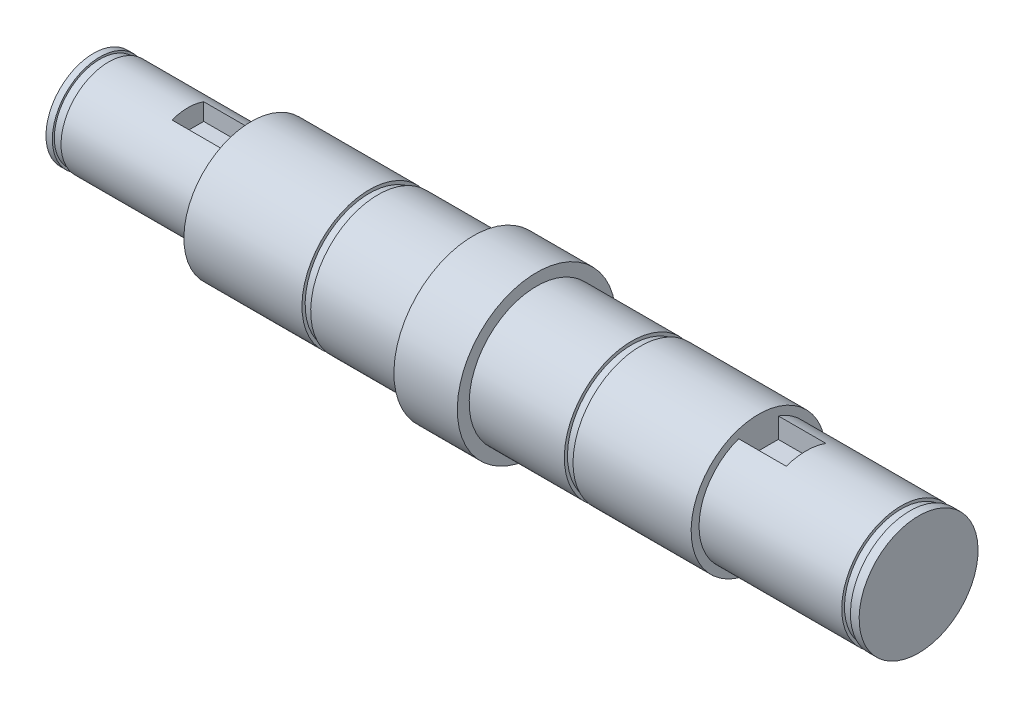
ISO-10303-21;
HEADER;
FILE_DESCRIPTION(('STEP AP214'),'2;1');
FILE_NAME('part.step','',(''),(''),'','','');
FILE_SCHEMA(('AUTOMOTIVE_DESIGN { 1 0 10303 214 1 1 1 1 }'));
ENDSEC;
DATA;
#1=APPLICATION_CONTEXT('core data for automotive mechanical design processes');
#2=APPLICATION_PROTOCOL_DEFINITION('international standard','automotive_design',2000,#1);
#3=PRODUCT_CONTEXT('',#1,'mechanical');
#4=PRODUCT('Part','Part','',(#3));
#5=PRODUCT_RELATED_PRODUCT_CATEGORY('part','',(#4));
#6=PRODUCT_DEFINITION_FORMATION('','',#4);
#7=PRODUCT_DEFINITION_CONTEXT('part definition',#1,'design');
#8=PRODUCT_DEFINITION('design','',#6,#7);
#9=PRODUCT_DEFINITION_SHAPE('','',#8);
#10=(LENGTH_UNIT() NAMED_UNIT(*) SI_UNIT(.MILLI.,.METRE.));
#11=(NAMED_UNIT(*) PLANE_ANGLE_UNIT() SI_UNIT($,.RADIAN.));
#12=(NAMED_UNIT(*) SI_UNIT($,.STERADIAN.) SOLID_ANGLE_UNIT());
#13=UNCERTAINTY_MEASURE_WITH_UNIT(LENGTH_MEASURE(1.E-05),#10,'distance_accuracy_value','');
#14=(GEOMETRIC_REPRESENTATION_CONTEXT(3) GLOBAL_UNCERTAINTY_ASSIGNED_CONTEXT((#13)) GLOBAL_UNIT_ASSIGNED_CONTEXT((#10,
#11,#12)) REPRESENTATION_CONTEXT('',''));
#15=CARTESIAN_POINT('',(0.,0.,0.));
#16=DIRECTION('',(0.,0.,1.));
#17=DIRECTION('',(1.,0.,0.));
#18=AXIS2_PLACEMENT_3D('',#15,#16,#17);
#19=CARTESIAN_POINT('',(-52.05,0.,0.));
#20=DIRECTION('',(-1.,0.,0.));
#21=DIRECTION('',(0.,-1.,0.));
#22=AXIS2_PLACEMENT_3D('',#19,#20,#21);
#23=CYLINDRICAL_SURFACE('',#22,7.49999999999998);
#24=CARTESIAN_POINT('',(49.85,0.,0.));
#25=DIRECTION('',(-1.,0.,0.));
#26=DIRECTION('',(0.,-1.,0.));
#27=AXIS2_PLACEMENT_3D('',#24,#25,#26);
#28=CIRCLE('',#27,7.49999999999998);
#29=CARTESIAN_POINT('',(49.85,-7.49999999999996,0.));
#30=VERTEX_POINT('',#29);
#31=EDGE_CURVE('E199',#30,#30,#28,.T.);
#32=ORIENTED_EDGE('',*,*,#31,.T.);
#33=EDGE_LOOP('',(#32));
#34=FACE_BOUND('',#33,.T.);
#35=DIRECTION('',(-1.,0.,0.));
#36=VECTOR('',#35,1.);
#37=CARTESIAN_POINT('',(-52.05,7.07106781186546,2.5));
#38=LINE('',#37,#36);
#39=CARTESIAN_POINT('',(31.85,7.07106781186547,2.5));
#40=VERTEX_POINT('',#39);
#41=CARTESIAN_POINT('',(37.85,7.07106781186547,2.5));
#42=VERTEX_POINT('',#41);
#43=EDGE_CURVE('E105',#40,#42,#38,.F.);
#44=ORIENTED_EDGE('',*,*,#43,.F.);
#45=CARTESIAN_POINT('',(31.85,0.,0.));
#46=DIRECTION('',(-1.,0.,0.));
#47=DIRECTION('',(0.,-1.,0.));
#48=AXIS2_PLACEMENT_3D('',#45,#46,#47);
#49=CIRCLE('',#48,7.49999999999998);
#50=CARTESIAN_POINT('',(31.85,7.07106781186547,-2.5));
#51=VERTEX_POINT('',#50);
#52=EDGE_CURVE('E196',#51,#40,#49,.T.);
#53=ORIENTED_EDGE('',*,*,#52,.F.);
#54=DIRECTION('',(-1.,0.,0.));
#55=VECTOR('',#54,1.);
#56=CARTESIAN_POINT('',(-52.05,7.07106781186546,-2.5));
#57=LINE('',#56,#55);
#58=CARTESIAN_POINT('',(37.85,7.07106781186547,-2.5));
#59=VERTEX_POINT('',#58);
#60=EDGE_CURVE('E121',#59,#51,#57,.T.);
#61=ORIENTED_EDGE('',*,*,#60,.F.);
#62=CARTESIAN_POINT('',(37.85,0.,0.));
#63=DIRECTION('',(1.,0.,0.));
#64=DIRECTION('',(0.,0.,-1.));
#65=AXIS2_PLACEMENT_3D('',#62,#63,#64);
#66=CIRCLE('',#65,7.49999999999998);
#67=EDGE_CURVE('E11',#59,#42,#66,.T.);
#68=ORIENTED_EDGE('',*,*,#67,.T.);
#69=EDGE_LOOP('',(#44,#53,#61,#68));
#70=FACE_BOUND('',#69,.T.);
#71=ADVANCED_FACE('F33',(#34,#70),#23,.T.);
#72=CARTESIAN_POINT('',(-52.05,0.,0.));
#73=DIRECTION('',(-1.,0.,0.));
#74=DIRECTION('',(0.,-1.,0.));
#75=AXIS2_PLACEMENT_3D('',#72,#73,#74);
#76=CYLINDRICAL_SURFACE('',#75,6.);
#77=CARTESIAN_POINT('',(-50.15,0.,0.));
#78=DIRECTION('',(-1.,0.,0.));
#79=DIRECTION('',(0.,-1.,0.));
#80=AXIS2_PLACEMENT_3D('',#77,#78,#79);
#81=CIRCLE('',#80,6.);
#82=CARTESIAN_POINT('',(-50.15,-6.,0.));
#83=VERTEX_POINT('',#82);
#84=EDGE_CURVE('E226',#83,#83,#81,.T.);
#85=ORIENTED_EDGE('',*,*,#84,.F.);
#86=EDGE_LOOP('',(#85));
#87=FACE_BOUND('',#86,.T.);
#88=DIRECTION('',(-1.,0.,0.));
#89=VECTOR('',#88,1.);
#90=CARTESIAN_POINT('',(-52.05,5.65685424949238,-2.));
#91=LINE('',#90,#89);
#92=CARTESIAN_POINT('',(-32.15,5.65685424949238,-2.));
#93=VERTEX_POINT('',#92);
#94=CARTESIAN_POINT('',(-40.15,5.65685424949238,-2.));
#95=VERTEX_POINT('',#94);
#96=EDGE_CURVE('E149',#93,#95,#91,.T.);
#97=ORIENTED_EDGE('',*,*,#96,.F.);
#98=CARTESIAN_POINT('',(-32.15,0.,0.));
#99=DIRECTION('',(-1.,0.,0.));
#100=DIRECTION('',(0.,-1.,0.));
#101=AXIS2_PLACEMENT_3D('',#98,#99,#100);
#102=CIRCLE('',#101,6.);
#103=CARTESIAN_POINT('',(-32.15,5.65685424949238,2.));
#104=VERTEX_POINT('',#103);
#105=EDGE_CURVE('E151',#93,#104,#102,.T.);
#106=ORIENTED_EDGE('',*,*,#105,.T.);
#107=DIRECTION('',(-1.,0.,0.));
#108=VECTOR('',#107,1.);
#109=CARTESIAN_POINT('',(-52.05,5.65685424949238,2.));
#110=LINE('',#109,#108);
#111=CARTESIAN_POINT('',(-40.15,5.65685424949238,2.));
#112=VERTEX_POINT('',#111);
#113=EDGE_CURVE('E147',#112,#104,#110,.F.);
#114=ORIENTED_EDGE('',*,*,#113,.F.);
#115=CARTESIAN_POINT('',(-40.15,0.,0.));
#116=DIRECTION('',(1.,0.,0.));
#117=DIRECTION('',(0.,0.,-1.));
#118=AXIS2_PLACEMENT_3D('',#115,#116,#117);
#119=CIRCLE('',#118,6.);
#120=EDGE_CURVE('E41',#95,#112,#119,.T.);
#121=ORIENTED_EDGE('',*,*,#120,.F.);
#122=EDGE_LOOP('',(#97,#106,#114,#121));
#123=FACE_BOUND('',#122,.T.);
#124=ADVANCED_FACE('F35',(#87,#123),#76,.T.);
#125=CARTESIAN_POINT('',(-50.15,6.,0.));
#126=DIRECTION('',(1.,0.,0.));
#127=DIRECTION('',(0.,1.,0.));
#128=AXIS2_PLACEMENT_3D('',#125,#126,#127);
#129=PLANE('',#128);
#130=CARTESIAN_POINT('',(-50.15,0.,0.));
#131=DIRECTION('',(-1.,0.,0.));
#132=DIRECTION('',(0.,-1.,0.));
#133=AXIS2_PLACEMENT_3D('',#130,#131,#132);
#134=CIRCLE('',#133,5.75);
#135=CARTESIAN_POINT('',(-50.15,-5.75,0.));
#136=VERTEX_POINT('',#135);
#137=EDGE_CURVE('E223',#136,#136,#134,.T.);
#138=ORIENTED_EDGE('',*,*,#137,.F.);
#139=EDGE_LOOP('',(#138));
#140=FACE_BOUND('',#139,.T.);
#141=ORIENTED_EDGE('',*,*,#84,.T.);
#142=EDGE_LOOP('',(#141));
#143=FACE_BOUND('',#142,.T.);
#144=ADVANCED_FACE('F260',(#140,#143),#129,.F.);
#145=CARTESIAN_POINT('',(-52.05,0.,0.));
#146=DIRECTION('',(-1.,0.,0.));
#147=DIRECTION('',(0.,-1.,0.));
#148=AXIS2_PLACEMENT_3D('',#145,#146,#147);
#149=CYLINDRICAL_SURFACE('',#148,5.75);
#150=CARTESIAN_POINT('',(-51.25,0.,0.));
#151=DIRECTION('',(-1.,0.,0.));
#152=DIRECTION('',(0.,-1.,0.));
#153=AXIS2_PLACEMENT_3D('',#150,#151,#152);
#154=CIRCLE('',#153,5.75);
#155=CARTESIAN_POINT('',(-51.25,-5.75,0.));
#156=VERTEX_POINT('',#155);
#157=EDGE_CURVE('E220',#156,#156,#154,.T.);
#158=ORIENTED_EDGE('',*,*,#157,.F.);
#159=EDGE_LOOP('',(#158));
#160=FACE_BOUND('',#159,.T.);
#161=ORIENTED_EDGE('',*,*,#137,.T.);
#162=EDGE_LOOP('',(#161));
#163=FACE_BOUND('',#162,.T.);
#164=ADVANCED_FACE('F298',(#160,#163),#149,.T.);
#165=CARTESIAN_POINT('',(-51.25,6.,0.));
#166=DIRECTION('',(-1.,0.,0.));
#167=DIRECTION('',(0.,-1.,0.));
#168=AXIS2_PLACEMENT_3D('',#165,#166,#167);
#169=PLANE('',#168);
#170=CARTESIAN_POINT('',(-51.25,0.,0.));
#171=DIRECTION('',(-1.,0.,0.));
#172=DIRECTION('',(0.,-1.,0.));
#173=AXIS2_PLACEMENT_3D('',#170,#171,#172);
#174=CIRCLE('',#173,6.);
#175=CARTESIAN_POINT('',(-51.25,-6.,0.));
#176=VERTEX_POINT('',#175);
#177=EDGE_CURVE('E217',#176,#176,#174,.T.);
#178=ORIENTED_EDGE('',*,*,#177,.F.);
#179=EDGE_LOOP('',(#178));
#180=FACE_BOUND('',#179,.T.);
#181=ORIENTED_EDGE('',*,*,#157,.T.);
#182=EDGE_LOOP('',(#181));
#183=FACE_BOUND('',#182,.T.);
#184=ADVANCED_FACE('F294',(#180,#183),#169,.F.);
#185=CARTESIAN_POINT('',(-52.05,0.,0.));
#186=DIRECTION('',(-1.,0.,0.));
#187=DIRECTION('',(0.,-1.,0.));
#188=AXIS2_PLACEMENT_3D('',#185,#186,#187);
#189=CYLINDRICAL_SURFACE('',#188,6.);
#190=CARTESIAN_POINT('',(-52.05,0.,0.));
#191=DIRECTION('',(-1.,0.,0.));
#192=DIRECTION('',(0.,-1.,0.));
#193=AXIS2_PLACEMENT_3D('',#190,#191,#192);
#194=CIRCLE('',#193,6.);
#195=CARTESIAN_POINT('',(-52.05,-6.,0.));
#196=VERTEX_POINT('',#195);
#197=EDGE_CURVE('E214',#196,#196,#194,.T.);
#198=ORIENTED_EDGE('',*,*,#197,.F.);
#199=EDGE_LOOP('',(#198));
#200=FACE_BOUND('',#199,.T.);
#201=ORIENTED_EDGE('',*,*,#177,.T.);
#202=EDGE_LOOP('',(#201));
#203=FACE_BOUND('',#202,.T.);
#204=ADVANCED_FACE('F290',(#200,#203),#189,.T.);
#205=CARTESIAN_POINT('',(-52.05,0.,0.));
#206=DIRECTION('',(1.,0.,0.));
#207=DIRECTION('',(0.,1.,0.));
#208=AXIS2_PLACEMENT_3D('',#205,#206,#207);
#209=PLANE('',#208);
#210=ORIENTED_EDGE('',*,*,#197,.T.);
#211=EDGE_LOOP('',(#210));
#212=FACE_BOUND('',#211,.T.);
#213=ADVANCED_FACE('F286',(#212),#209,.F.);
#214=CARTESIAN_POINT('',(52.05,7.5,0.));
#215=DIRECTION('',(-1.,0.,0.));
#216=DIRECTION('',(0.,-1.,0.));
#217=AXIS2_PLACEMENT_3D('',#214,#215,#216);
#218=PLANE('',#217);
#219=CARTESIAN_POINT('',(52.05,0.,0.));
#220=DIRECTION('',(-1.,0.,0.));
#221=DIRECTION('',(0.,-1.,0.));
#222=AXIS2_PLACEMENT_3D('',#219,#220,#221);
#223=CIRCLE('',#222,7.49999999999998);
#224=CARTESIAN_POINT('',(52.05,-7.49999999999996,0.));
#225=VERTEX_POINT('',#224);
#226=EDGE_CURVE('E211',#225,#225,#223,.T.);
#227=ORIENTED_EDGE('',*,*,#226,.F.);
#228=EDGE_LOOP('',(#227));
#229=FACE_BOUND('',#228,.T.);
#230=ADVANCED_FACE('F282',(#229),#218,.F.);
#231=CARTESIAN_POINT('',(-52.05,0.,0.));
#232=DIRECTION('',(-1.,0.,0.));
#233=DIRECTION('',(0.,-1.,0.));
#234=AXIS2_PLACEMENT_3D('',#231,#232,#233);
#235=CYLINDRICAL_SURFACE('',#234,7.49999999999998);
#236=CARTESIAN_POINT('',(50.95,0.,0.));
#237=DIRECTION('',(-1.,0.,0.));
#238=DIRECTION('',(0.,-1.,0.));
#239=AXIS2_PLACEMENT_3D('',#236,#237,#238);
#240=CIRCLE('',#239,7.49999999999998);
#241=CARTESIAN_POINT('',(50.95,-7.49999999999996,0.));
#242=VERTEX_POINT('',#241);
#243=EDGE_CURVE('E208',#242,#242,#240,.T.);
#244=ORIENTED_EDGE('',*,*,#243,.F.);
#245=EDGE_LOOP('',(#244));
#246=FACE_BOUND('',#245,.T.);
#247=ORIENTED_EDGE('',*,*,#226,.T.);
#248=EDGE_LOOP('',(#247));
#249=FACE_BOUND('',#248,.T.);
#250=ADVANCED_FACE('F278',(#246,#249),#235,.T.);
#251=CARTESIAN_POINT('',(50.95,7.5,0.));
#252=DIRECTION('',(1.,0.,0.));
#253=DIRECTION('',(0.,1.,0.));
#254=AXIS2_PLACEMENT_3D('',#251,#252,#253);
#255=PLANE('',#254);
#256=CARTESIAN_POINT('',(50.95,0.,0.));
#257=DIRECTION('',(-1.,0.,0.));
#258=DIRECTION('',(0.,-1.,0.));
#259=AXIS2_PLACEMENT_3D('',#256,#257,#258);
#260=CIRCLE('',#259,7.14999999999998);
#261=CARTESIAN_POINT('',(50.95,-7.14999999999996,0.));
#262=VERTEX_POINT('',#261);
#263=EDGE_CURVE('E205',#262,#262,#260,.T.);
#264=ORIENTED_EDGE('',*,*,#263,.F.);
#265=EDGE_LOOP('',(#264));
#266=FACE_BOUND('',#265,.T.);
#267=ORIENTED_EDGE('',*,*,#243,.T.);
#268=EDGE_LOOP('',(#267));
#269=FACE_BOUND('',#268,.T.);
#270=ADVANCED_FACE('F274',(#266,#269),#255,.F.);
#271=CARTESIAN_POINT('',(-52.05,0.,0.));
#272=DIRECTION('',(-1.,0.,0.));
#273=DIRECTION('',(0.,-1.,0.));
#274=AXIS2_PLACEMENT_3D('',#271,#272,#273);
#275=CYLINDRICAL_SURFACE('',#274,7.14999999999998);
#276=CARTESIAN_POINT('',(49.85,0.,0.));
#277=DIRECTION('',(-1.,0.,0.));
#278=DIRECTION('',(0.,-1.,0.));
#279=AXIS2_PLACEMENT_3D('',#276,#277,#278);
#280=CIRCLE('',#279,7.14999999999998);
#281=CARTESIAN_POINT('',(49.85,-7.14999999999996,0.));
#282=VERTEX_POINT('',#281);
#283=EDGE_CURVE('E202',#282,#282,#280,.T.);
#284=ORIENTED_EDGE('',*,*,#283,.F.);
#285=EDGE_LOOP('',(#284));
#286=FACE_BOUND('',#285,.T.);
#287=ORIENTED_EDGE('',*,*,#263,.T.);
#288=EDGE_LOOP('',(#287));
#289=FACE_BOUND('',#288,.T.);
#290=ADVANCED_FACE('F270',(#286,#289),#275,.T.);
#291=CARTESIAN_POINT('',(49.85,7.5,0.));
#292=DIRECTION('',(-1.,0.,0.));
#293=DIRECTION('',(0.,-1.,0.));
#294=AXIS2_PLACEMENT_3D('',#291,#292,#293);
#295=PLANE('',#294);
#296=ORIENTED_EDGE('',*,*,#31,.F.);
#297=EDGE_LOOP('',(#296));
#298=FACE_BOUND('',#297,.T.);
#299=ORIENTED_EDGE('',*,*,#283,.T.);
#300=EDGE_LOOP('',(#299));
#301=FACE_BOUND('',#300,.T.);
#302=ADVANCED_FACE('F267',(#298,#301),#295,.F.);
#303=CARTESIAN_POINT('',(31.85,8.5,0.));
#304=DIRECTION('',(-1.,0.,0.));
#305=DIRECTION('',(0.,-1.,0.));
#306=AXIS2_PLACEMENT_3D('',#303,#304,#305);
#307=PLANE('',#306);
#308=DIRECTION('',(0.,1.,0.));
#309=VECTOR('',#308,1.);
#310=CARTESIAN_POINT('',(31.85,7.5,-2.5));
#311=LINE('',#310,#309);
#312=CARTESIAN_POINT('',(31.85,4.5,-2.5));
#313=VERTEX_POINT('',#312);
#314=EDGE_CURVE('E108',#313,#51,#311,.T.);
#315=ORIENTED_EDGE('',*,*,#314,.T.);
#316=ORIENTED_EDGE('',*,*,#52,.T.);
#317=DIRECTION('',(0.,-1.,0.));
#318=VECTOR('',#317,1.);
#319=CARTESIAN_POINT('',(31.85,7.5,2.5));
#320=LINE('',#319,#318);
#321=CARTESIAN_POINT('',(31.85,4.5,2.5));
#322=VERTEX_POINT('',#321);
#323=EDGE_CURVE('E535',#40,#322,#320,.T.);
#324=ORIENTED_EDGE('',*,*,#323,.T.);
#325=DIRECTION('',(0.,0.,-1.));
#326=VECTOR('',#325,1.);
#327=CARTESIAN_POINT('',(31.85,4.5,2.5));
#328=LINE('',#327,#326);
#329=EDGE_CURVE('E120',#322,#313,#328,.T.);
#330=ORIENTED_EDGE('',*,*,#329,.T.);
#331=EDGE_LOOP('',(#315,#316,#324,#330));
#332=FACE_BOUND('',#331,.T.);
#333=CARTESIAN_POINT('',(31.85,0.,0.));
#334=DIRECTION('',(-1.,0.,0.));
#335=DIRECTION('',(0.,-1.,0.));
#336=AXIS2_PLACEMENT_3D('',#333,#334,#335);
#337=CIRCLE('',#336,8.49999999999999);
#338=CARTESIAN_POINT('',(31.85,-8.49999999999997,0.));
#339=VERTEX_POINT('',#338);
#340=EDGE_CURVE('E193',#339,#339,#337,.T.);
#341=ORIENTED_EDGE('',*,*,#340,.F.);
#342=EDGE_LOOP('',(#341));
#343=FACE_BOUND('',#342,.T.);
#344=ADVANCED_FACE('F265',(#332,#343),#307,.F.);
#345=CARTESIAN_POINT('',(-52.05,0.,0.));
#346=DIRECTION('',(-1.,0.,0.));
#347=DIRECTION('',(0.,-1.,0.));
#348=AXIS2_PLACEMENT_3D('',#345,#346,#347);
#349=CYLINDRICAL_SURFACE('',#348,8.49999999999999);
#350=CARTESIAN_POINT('',(16.95,0.,0.));
#351=DIRECTION('',(-1.,0.,0.));
#352=DIRECTION('',(0.,-1.,0.));
#353=AXIS2_PLACEMENT_3D('',#350,#351,#352);
#354=CIRCLE('',#353,8.49999999999999);
#355=CARTESIAN_POINT('',(16.95,-8.49999999999998,0.));
#356=VERTEX_POINT('',#355);
#357=EDGE_CURVE('E190',#356,#356,#354,.T.);
#358=ORIENTED_EDGE('',*,*,#357,.F.);
#359=EDGE_LOOP('',(#358));
#360=FACE_BOUND('',#359,.T.);
#361=ORIENTED_EDGE('',*,*,#340,.T.);
#362=EDGE_LOOP('',(#361));
#363=FACE_BOUND('',#362,.T.);
#364=ADVANCED_FACE('F355',(#360,#363),#349,.T.);
#365=CARTESIAN_POINT('',(16.95,8.5,0.));
#366=DIRECTION('',(1.,0.,0.));
#367=DIRECTION('',(0.,1.,0.));
#368=AXIS2_PLACEMENT_3D('',#365,#366,#367);
#369=PLANE('',#368);
#370=CARTESIAN_POINT('',(16.95,0.,0.));
#371=DIRECTION('',(-1.,0.,0.));
#372=DIRECTION('',(0.,-1.,0.));
#373=AXIS2_PLACEMENT_3D('',#370,#371,#372);
#374=CIRCLE('',#373,8.09999999999999);
#375=CARTESIAN_POINT('',(16.95,-8.09999999999998,0.));
#376=VERTEX_POINT('',#375);
#377=EDGE_CURVE('E187',#376,#376,#374,.T.);
#378=ORIENTED_EDGE('',*,*,#377,.F.);
#379=EDGE_LOOP('',(#378));
#380=FACE_BOUND('',#379,.T.);
#381=ORIENTED_EDGE('',*,*,#357,.T.);
#382=EDGE_LOOP('',(#381));
#383=FACE_BOUND('',#382,.T.);
#384=ADVANCED_FACE('F362',(#380,#383),#369,.F.);
#385=CARTESIAN_POINT('',(-52.05,0.,0.));
#386=DIRECTION('',(-1.,0.,0.));
#387=DIRECTION('',(0.,-1.,0.));
#388=AXIS2_PLACEMENT_3D('',#385,#386,#387);
#389=CYLINDRICAL_SURFACE('',#388,8.09999999999999);
#390=CARTESIAN_POINT('',(15.85,0.,0.));
#391=DIRECTION('',(-1.,0.,0.));
#392=DIRECTION('',(0.,-1.,0.));
#393=AXIS2_PLACEMENT_3D('',#390,#391,#392);
#394=CIRCLE('',#393,8.09999999999999);
#395=CARTESIAN_POINT('',(15.85,-8.09999999999998,0.));
#396=VERTEX_POINT('',#395);
#397=EDGE_CURVE('E184',#396,#396,#394,.T.);
#398=ORIENTED_EDGE('',*,*,#397,.F.);
#399=EDGE_LOOP('',(#398));
#400=FACE_BOUND('',#399,.T.);
#401=ORIENTED_EDGE('',*,*,#377,.T.);
#402=EDGE_LOOP('',(#401));
#403=FACE_BOUND('',#402,.T.);
#404=ADVANCED_FACE('F369',(#400,#403),#389,.T.);
#405=CARTESIAN_POINT('',(15.85,8.5,0.));
#406=DIRECTION('',(-1.,0.,0.));
#407=DIRECTION('',(0.,-1.,0.));
#408=AXIS2_PLACEMENT_3D('',#405,#406,#407);
#409=PLANE('',#408);
#410=CARTESIAN_POINT('',(15.85,0.,0.));
#411=DIRECTION('',(-1.,0.,0.));
#412=DIRECTION('',(0.,-1.,0.));
#413=AXIS2_PLACEMENT_3D('',#410,#411,#412);
#414=CIRCLE('',#413,8.49999999999999);
#415=CARTESIAN_POINT('',(15.85,-8.49999999999998,0.));
#416=VERTEX_POINT('',#415);
#417=EDGE_CURVE('E181',#416,#416,#414,.T.);
#418=ORIENTED_EDGE('',*,*,#417,.F.);
#419=EDGE_LOOP('',(#418));
#420=FACE_BOUND('',#419,.T.);
#421=ORIENTED_EDGE('',*,*,#397,.T.);
#422=EDGE_LOOP('',(#421));
#423=FACE_BOUND('',#422,.T.);
#424=ADVANCED_FACE('F377',(#420,#423),#409,.F.);
#425=CARTESIAN_POINT('',(-52.05,0.,0.));
#426=DIRECTION('',(-1.,0.,0.));
#427=DIRECTION('',(0.,-1.,0.));
#428=AXIS2_PLACEMENT_3D('',#425,#426,#427);
#429=CYLINDRICAL_SURFACE('',#428,8.49999999999999);
#430=CARTESIAN_POINT('',(3.85000000000001,0.,0.));
#431=DIRECTION('',(-1.,0.,0.));
#432=DIRECTION('',(0.,-1.,0.));
#433=AXIS2_PLACEMENT_3D('',#430,#431,#432);
#434=CIRCLE('',#433,8.49999999999999);
#435=CARTESIAN_POINT('',(3.85000000000001,-8.49999999999998,0.));
#436=VERTEX_POINT('',#435);
#437=EDGE_CURVE('E178',#436,#436,#434,.T.);
#438=ORIENTED_EDGE('',*,*,#437,.F.);
#439=EDGE_LOOP('',(#438));
#440=FACE_BOUND('',#439,.T.);
#441=ORIENTED_EDGE('',*,*,#417,.T.);
#442=EDGE_LOOP('',(#441));
#443=FACE_BOUND('',#442,.T.);
#444=ADVANCED_FACE('F385',(#440,#443),#429,.T.);
#445=CARTESIAN_POINT('',(3.85,10.,0.));
#446=DIRECTION('',(-1.,0.,0.));
#447=DIRECTION('',(0.,-1.,0.));
#448=AXIS2_PLACEMENT_3D('',#445,#446,#447);
#449=PLANE('',#448);
#450=CARTESIAN_POINT('',(3.85000000000001,0.,0.));
#451=DIRECTION('',(-1.,0.,0.));
#452=DIRECTION('',(0.,-1.,0.));
#453=AXIS2_PLACEMENT_3D('',#450,#451,#452);
#454=CIRCLE('',#453,9.99999999999999);
#455=CARTESIAN_POINT('',(3.85000000000001,-9.99999999999998,0.));
#456=VERTEX_POINT('',#455);
#457=EDGE_CURVE('E175',#456,#456,#454,.T.);
#458=ORIENTED_EDGE('',*,*,#457,.F.);
#459=EDGE_LOOP('',(#458));
#460=FACE_BOUND('',#459,.T.);
#461=ORIENTED_EDGE('',*,*,#437,.T.);
#462=EDGE_LOOP('',(#461));
#463=FACE_BOUND('',#462,.T.);
#464=ADVANCED_FACE('F393',(#460,#463),#449,.F.);
#465=CARTESIAN_POINT('',(-52.05,0.,0.));
#466=DIRECTION('',(-1.,0.,0.));
#467=DIRECTION('',(0.,-1.,0.));
#468=AXIS2_PLACEMENT_3D('',#465,#466,#467);
#469=CYLINDRICAL_SURFACE('',#468,9.99999999999999);
#470=CARTESIAN_POINT('',(-4.15,0.,0.));
#471=DIRECTION('',(-1.,0.,0.));
#472=DIRECTION('',(0.,-1.,0.));
#473=AXIS2_PLACEMENT_3D('',#470,#471,#472);
#474=CIRCLE('',#473,9.99999999999999);
#475=CARTESIAN_POINT('',(-4.15,-9.99999999999998,0.));
#476=VERTEX_POINT('',#475);
#477=EDGE_CURVE('E172',#476,#476,#474,.T.);
#478=ORIENTED_EDGE('',*,*,#477,.F.);
#479=EDGE_LOOP('',(#478));
#480=FACE_BOUND('',#479,.T.);
#481=ORIENTED_EDGE('',*,*,#457,.T.);
#482=EDGE_LOOP('',(#481));
#483=FACE_BOUND('',#482,.T.);
#484=ADVANCED_FACE('F401',(#480,#483),#469,.T.);
#485=CARTESIAN_POINT('',(-4.15,8.5,0.));
#486=DIRECTION('',(1.,0.,0.));
#487=DIRECTION('',(0.,1.,0.));
#488=AXIS2_PLACEMENT_3D('',#485,#486,#487);
#489=PLANE('',#488);
#490=CARTESIAN_POINT('',(-4.15,0.,0.));
#491=DIRECTION('',(-1.,0.,0.));
#492=DIRECTION('',(0.,-1.,0.));
#493=AXIS2_PLACEMENT_3D('',#490,#491,#492);
#494=CIRCLE('',#493,8.49999999999999);
#495=CARTESIAN_POINT('',(-4.15,-8.49999999999998,0.));
#496=VERTEX_POINT('',#495);
#497=EDGE_CURVE('E169',#496,#496,#494,.T.);
#498=ORIENTED_EDGE('',*,*,#497,.F.);
#499=EDGE_LOOP('',(#498));
#500=FACE_BOUND('',#499,.T.);
#501=ORIENTED_EDGE('',*,*,#477,.T.);
#502=EDGE_LOOP('',(#501));
#503=FACE_BOUND('',#502,.T.);
#504=ADVANCED_FACE('F409',(#500,#503),#489,.F.);
#505=CARTESIAN_POINT('',(-52.05,0.,0.));
#506=DIRECTION('',(-1.,0.,0.));
#507=DIRECTION('',(0.,-1.,0.));
#508=AXIS2_PLACEMENT_3D('',#505,#506,#507);
#509=CYLINDRICAL_SURFACE('',#508,8.49999999999999);
#510=CARTESIAN_POINT('',(-16.15,0.,0.));
#511=DIRECTION('',(-1.,0.,0.));
#512=DIRECTION('',(0.,-1.,0.));
#513=AXIS2_PLACEMENT_3D('',#510,#511,#512);
#514=CIRCLE('',#513,8.49999999999999);
#515=CARTESIAN_POINT('',(-16.15,-8.49999999999999,0.));
#516=VERTEX_POINT('',#515);
#517=EDGE_CURVE('E166',#516,#516,#514,.T.);
#518=ORIENTED_EDGE('',*,*,#517,.F.);
#519=EDGE_LOOP('',(#518));
#520=FACE_BOUND('',#519,.T.);
#521=ORIENTED_EDGE('',*,*,#497,.T.);
#522=EDGE_LOOP('',(#521));
#523=FACE_BOUND('',#522,.T.);
#524=ADVANCED_FACE('F417',(#520,#523),#509,.T.);
#525=CARTESIAN_POINT('',(-16.15,8.5,0.));
#526=DIRECTION('',(1.,0.,0.));
#527=DIRECTION('',(0.,1.,0.));
#528=AXIS2_PLACEMENT_3D('',#525,#526,#527);
#529=PLANE('',#528);
#530=CARTESIAN_POINT('',(-16.15,0.,0.));
#531=DIRECTION('',(-1.,0.,0.));
#532=DIRECTION('',(0.,-1.,0.));
#533=AXIS2_PLACEMENT_3D('',#530,#531,#532);
#534=CIRCLE('',#533,8.09999999999999);
#535=CARTESIAN_POINT('',(-16.15,-8.09999999999999,0.));
#536=VERTEX_POINT('',#535);
#537=EDGE_CURVE('E163',#536,#536,#534,.T.);
#538=ORIENTED_EDGE('',*,*,#537,.F.);
#539=EDGE_LOOP('',(#538));
#540=FACE_BOUND('',#539,.T.);
#541=ORIENTED_EDGE('',*,*,#517,.T.);
#542=EDGE_LOOP('',(#541));
#543=FACE_BOUND('',#542,.T.);
#544=ADVANCED_FACE('F425',(#540,#543),#529,.F.);
#545=CARTESIAN_POINT('',(-52.05,0.,0.));
#546=DIRECTION('',(-1.,0.,0.));
#547=DIRECTION('',(0.,-1.,0.));
#548=AXIS2_PLACEMENT_3D('',#545,#546,#547);
#549=CYLINDRICAL_SURFACE('',#548,8.09999999999999);
#550=CARTESIAN_POINT('',(-17.25,0.,0.));
#551=DIRECTION('',(-1.,0.,0.));
#552=DIRECTION('',(0.,-1.,0.));
#553=AXIS2_PLACEMENT_3D('',#550,#551,#552);
#554=CIRCLE('',#553,8.09999999999999);
#555=CARTESIAN_POINT('',(-17.25,-8.09999999999999,0.));
#556=VERTEX_POINT('',#555);
#557=EDGE_CURVE('E160',#556,#556,#554,.T.);
#558=ORIENTED_EDGE('',*,*,#557,.F.);
#559=EDGE_LOOP('',(#558));
#560=FACE_BOUND('',#559,.T.);
#561=ORIENTED_EDGE('',*,*,#537,.T.);
#562=EDGE_LOOP('',(#561));
#563=FACE_BOUND('',#562,.T.);
#564=ADVANCED_FACE('F433',(#560,#563),#549,.T.);
#565=CARTESIAN_POINT('',(-17.25,8.5,0.));
#566=DIRECTION('',(-1.,0.,0.));
#567=DIRECTION('',(0.,-1.,0.));
#568=AXIS2_PLACEMENT_3D('',#565,#566,#567);
#569=PLANE('',#568);
#570=CARTESIAN_POINT('',(-17.25,0.,0.));
#571=DIRECTION('',(-1.,0.,0.));
#572=DIRECTION('',(0.,-1.,0.));
#573=AXIS2_PLACEMENT_3D('',#570,#571,#572);
#574=CIRCLE('',#573,8.49999999999999);
#575=CARTESIAN_POINT('',(-17.25,-8.49999999999999,0.));
#576=VERTEX_POINT('',#575);
#577=EDGE_CURVE('E157',#576,#576,#574,.T.);
#578=ORIENTED_EDGE('',*,*,#577,.F.);
#579=EDGE_LOOP('',(#578));
#580=FACE_BOUND('',#579,.T.);
#581=ORIENTED_EDGE('',*,*,#557,.T.);
#582=EDGE_LOOP('',(#581));
#583=FACE_BOUND('',#582,.T.);
#584=ADVANCED_FACE('F441',(#580,#583),#569,.F.);
#585=CARTESIAN_POINT('',(-52.05,0.,0.));
#586=DIRECTION('',(-1.,0.,0.));
#587=DIRECTION('',(0.,-1.,0.));
#588=AXIS2_PLACEMENT_3D('',#585,#586,#587);
#589=CYLINDRICAL_SURFACE('',#588,8.49999999999999);
#590=CARTESIAN_POINT('',(-32.15,0.,0.));
#591=DIRECTION('',(-1.,0.,0.));
#592=DIRECTION('',(0.,-1.,0.));
#593=AXIS2_PLACEMENT_3D('',#590,#591,#592);
#594=CIRCLE('',#593,8.5);
#595=CARTESIAN_POINT('',(-32.15,-8.49999999999999,0.));
#596=VERTEX_POINT('',#595);
#597=EDGE_CURVE('E154',#596,#596,#594,.T.);
#598=ORIENTED_EDGE('',*,*,#597,.F.);
#599=EDGE_LOOP('',(#598));
#600=FACE_BOUND('',#599,.T.);
#601=ORIENTED_EDGE('',*,*,#577,.T.);
#602=EDGE_LOOP('',(#601));
#603=FACE_BOUND('',#602,.T.);
#604=ADVANCED_FACE('F449',(#600,#603),#589,.T.);
#605=CARTESIAN_POINT('',(-32.15,6.,0.));
#606=DIRECTION('',(1.,0.,0.));
#607=DIRECTION('',(0.,1.,0.));
#608=AXIS2_PLACEMENT_3D('',#605,#606,#607);
#609=PLANE('',#608);
#610=ORIENTED_EDGE('',*,*,#105,.F.);
#611=DIRECTION('',(0.,-1.,0.));
#612=VECTOR('',#611,1.);
#613=CARTESIAN_POINT('',(-32.15,3.5,-2.));
#614=LINE('',#613,#612);
#615=CARTESIAN_POINT('',(-32.15,3.5,-2.));
#616=VERTEX_POINT('',#615);
#617=EDGE_CURVE('E129',#93,#616,#614,.T.);
#618=ORIENTED_EDGE('',*,*,#617,.T.);
#619=DIRECTION('',(0.,0.,1.));
#620=VECTOR('',#619,1.);
#621=CARTESIAN_POINT('',(-32.15,3.5,-2.));
#622=LINE('',#621,#620);
#623=CARTESIAN_POINT('',(-32.15,3.5,2.));
#624=VERTEX_POINT('',#623);
#625=EDGE_CURVE('E139',#616,#624,#622,.T.);
#626=ORIENTED_EDGE('',*,*,#625,.T.);
#627=DIRECTION('',(0.,1.,0.));
#628=VECTOR('',#627,1.);
#629=CARTESIAN_POINT('',(-32.15,3.5,2.));
#630=LINE('',#629,#628);
#631=EDGE_CURVE('E48',#624,#104,#630,.T.);
#632=ORIENTED_EDGE('',*,*,#631,.T.);
#633=EDGE_LOOP('',(#610,#618,#626,#632));
#634=FACE_BOUND('',#633,.T.);
#635=ORIENTED_EDGE('',*,*,#597,.T.);
#636=EDGE_LOOP('',(#635));
#637=FACE_BOUND('',#636,.T.);
#638=ADVANCED_FACE('F236',(#634,#637),#609,.F.);
#639=CARTESIAN_POINT('',(-40.15,0.,0.));
#640=DIRECTION('',(1.,0.,0.));
#641=DIRECTION('',(0.,0.,-1.));
#642=AXIS2_PLACEMENT_3D('',#639,#640,#641);
#643=PLANE('',#642);
#644=DIRECTION('',(0.,-1.,0.));
#645=VECTOR('',#644,1.);
#646=CARTESIAN_POINT('',(-40.15,3.5,-2.));
#647=LINE('',#646,#645);
#648=CARTESIAN_POINT('',(-40.15,3.5,-2.));
#649=VERTEX_POINT('',#648);
#650=EDGE_CURVE('E130',#95,#649,#647,.T.);
#651=ORIENTED_EDGE('',*,*,#650,.F.);
#652=ORIENTED_EDGE('',*,*,#120,.T.);
#653=DIRECTION('',(0.,1.,0.));
#654=VECTOR('',#653,1.);
#655=CARTESIAN_POINT('',(-40.15,3.5,2.));
#656=LINE('',#655,#654);
#657=CARTESIAN_POINT('',(-40.15,3.5,2.));
#658=VERTEX_POINT('',#657);
#659=EDGE_CURVE('E134',#658,#112,#656,.T.);
#660=ORIENTED_EDGE('',*,*,#659,.F.);
#661=DIRECTION('',(0.,0.,1.));
#662=VECTOR('',#661,1.);
#663=CARTESIAN_POINT('',(-40.15,3.5,-2.));
#664=LINE('',#663,#662);
#665=EDGE_CURVE('E132',#649,#658,#664,.T.);
#666=ORIENTED_EDGE('',*,*,#665,.F.);
#667=EDGE_LOOP('',(#651,#652,#660,#666));
#668=FACE_BOUND('',#667,.T.);
#669=ADVANCED_FACE('F231',(#668),#643,.T.);
#670=CARTESIAN_POINT('',(-40.15,3.5,-2.));
#671=DIRECTION('',(0.,0.,1.));
#672=DIRECTION('',(1.,0.,0.));
#673=AXIS2_PLACEMENT_3D('',#670,#671,#672);
#674=PLANE('',#673);
#675=ORIENTED_EDGE('',*,*,#96,.T.);
#676=ORIENTED_EDGE('',*,*,#650,.T.);
#677=DIRECTION('',(1.,0.,0.));
#678=VECTOR('',#677,1.);
#679=CARTESIAN_POINT('',(-40.15,3.5,-2.));
#680=LINE('',#679,#678);
#681=EDGE_CURVE('E144',#649,#616,#680,.T.);
#682=ORIENTED_EDGE('',*,*,#681,.T.);
#683=ORIENTED_EDGE('',*,*,#617,.F.);
#684=EDGE_LOOP('',(#675,#676,#682,#683));
#685=FACE_BOUND('',#684,.T.);
#686=ADVANCED_FACE('F243',(#685),#674,.T.);
#687=CARTESIAN_POINT('',(-40.15,3.5,2.));
#688=DIRECTION('',(0.,0.,-1.));
#689=DIRECTION('',(0.,1.,0.));
#690=AXIS2_PLACEMENT_3D('',#687,#688,#689);
#691=PLANE('',#690);
#692=ORIENTED_EDGE('',*,*,#113,.T.);
#693=ORIENTED_EDGE('',*,*,#631,.F.);
#694=DIRECTION('',(1.,0.,0.));
#695=VECTOR('',#694,1.);
#696=CARTESIAN_POINT('',(-40.15,3.5,2.));
#697=LINE('',#696,#695);
#698=EDGE_CURVE('E137',#658,#624,#697,.T.);
#699=ORIENTED_EDGE('',*,*,#698,.F.);
#700=ORIENTED_EDGE('',*,*,#659,.T.);
#701=EDGE_LOOP('',(#692,#693,#699,#700));
#702=FACE_BOUND('',#701,.T.);
#703=ADVANCED_FACE('F235',(#702),#691,.T.);
#704=CARTESIAN_POINT('',(-40.15,3.5,-2.));
#705=DIRECTION('',(0.,1.,0.));
#706=DIRECTION('',(-1.,0.,0.));
#707=AXIS2_PLACEMENT_3D('',#704,#705,#706);
#708=PLANE('',#707);
#709=ORIENTED_EDGE('',*,*,#625,.F.);
#710=ORIENTED_EDGE('',*,*,#681,.F.);
#711=ORIENTED_EDGE('',*,*,#665,.T.);
#712=ORIENTED_EDGE('',*,*,#698,.T.);
#713=EDGE_LOOP('',(#709,#710,#711,#712));
#714=FACE_BOUND('',#713,.T.);
#715=ADVANCED_FACE('F242',(#714),#708,.T.);
#716=CARTESIAN_POINT('',(37.85,0.,0.));
#717=DIRECTION('',(1.,0.,0.));
#718=DIRECTION('',(0.,0.,-1.));
#719=AXIS2_PLACEMENT_3D('',#716,#717,#718);
#720=PLANE('',#719);
#721=DIRECTION('',(0.,1.,0.));
#722=VECTOR('',#721,1.);
#723=CARTESIAN_POINT('',(37.85,7.5,-2.5));
#724=LINE('',#723,#722);
#725=CARTESIAN_POINT('',(37.85,4.5,-2.5));
#726=VERTEX_POINT('',#725);
#727=EDGE_CURVE('E113',#726,#59,#724,.T.);
#728=ORIENTED_EDGE('',*,*,#727,.F.);
#729=DIRECTION('',(0.,0.,-1.));
#730=VECTOR('',#729,1.);
#731=CARTESIAN_POINT('',(37.85,4.5,2.5));
#732=LINE('',#731,#730);
#733=CARTESIAN_POINT('',(37.85,4.5,2.5));
#734=VERTEX_POINT('',#733);
#735=EDGE_CURVE('E107',#734,#726,#732,.T.);
#736=ORIENTED_EDGE('',*,*,#735,.F.);
#737=DIRECTION('',(0.,-1.,0.));
#738=VECTOR('',#737,1.);
#739=CARTESIAN_POINT('',(37.85,7.5,2.5));
#740=LINE('',#739,#738);
#741=EDGE_CURVE('E99',#42,#734,#740,.T.);
#742=ORIENTED_EDGE('',*,*,#741,.F.);
#743=ORIENTED_EDGE('',*,*,#67,.F.);
#744=EDGE_LOOP('',(#728,#736,#742,#743));
#745=FACE_BOUND('',#744,.T.);
#746=ADVANCED_FACE('F111',(#745),#720,.F.);
#747=CARTESIAN_POINT('',(37.85,7.5,2.5));
#748=DIRECTION('',(0.,0.,-1.));
#749=DIRECTION('',(-1.,0.,0.));
#750=AXIS2_PLACEMENT_3D('',#747,#748,#749);
#751=PLANE('',#750);
#752=ORIENTED_EDGE('',*,*,#43,.T.);
#753=ORIENTED_EDGE('',*,*,#741,.T.);
#754=DIRECTION('',(-1.,0.,0.));
#755=VECTOR('',#754,1.);
#756=CARTESIAN_POINT('',(37.85,4.5,2.5));
#757=LINE('',#756,#755);
#758=EDGE_CURVE('E103',#734,#322,#757,.T.);
#759=ORIENTED_EDGE('',*,*,#758,.T.);
#760=ORIENTED_EDGE('',*,*,#323,.F.);
#761=EDGE_LOOP('',(#752,#753,#759,#760));
#762=FACE_BOUND('',#761,.T.);
#763=ADVANCED_FACE('F101',(#762),#751,.T.);
#764=CARTESIAN_POINT('',(37.85,7.5,-2.5));
#765=DIRECTION('',(0.,0.,1.));
#766=DIRECTION('',(1.,0.,0.));
#767=AXIS2_PLACEMENT_3D('',#764,#765,#766);
#768=PLANE('',#767);
#769=ORIENTED_EDGE('',*,*,#60,.T.);
#770=ORIENTED_EDGE('',*,*,#314,.F.);
#771=DIRECTION('',(-1.,0.,0.));
#772=VECTOR('',#771,1.);
#773=CARTESIAN_POINT('',(37.85,4.5,-2.5));
#774=LINE('',#773,#772);
#775=EDGE_CURVE('E122',#726,#313,#774,.T.);
#776=ORIENTED_EDGE('',*,*,#775,.F.);
#777=ORIENTED_EDGE('',*,*,#727,.T.);
#778=EDGE_LOOP('',(#769,#770,#776,#777));
#779=FACE_BOUND('',#778,.T.);
#780=ADVANCED_FACE('F509',(#779),#768,.T.);
#781=CARTESIAN_POINT('',(37.85,4.5,2.5));
#782=DIRECTION('',(0.,1.,0.));
#783=DIRECTION('',(-1.,0.,0.));
#784=AXIS2_PLACEMENT_3D('',#781,#782,#783);
#785=PLANE('',#784);
#786=ORIENTED_EDGE('',*,*,#329,.F.);
#787=ORIENTED_EDGE('',*,*,#758,.F.);
#788=ORIENTED_EDGE('',*,*,#735,.T.);
#789=ORIENTED_EDGE('',*,*,#775,.T.);
#790=EDGE_LOOP('',(#786,#787,#788,#789));
#791=FACE_BOUND('',#790,.T.);
#792=ADVANCED_FACE('F119',(#791),#785,.T.);
#793=CLOSED_SHELL('',(#71,#124,#144,#164,#184,#204,#213,#230,#250,#270,#290,#302,#344,#364,#384,
#404,#424,#444,#464,#484,#504,#524,#544,#564,#584,#604,#638,#669,#686,#703,#715,#746,#763,#780,#792));
#794=MANIFOLD_SOLID_BREP('B2',#793);
#795=ADVANCED_BREP_SHAPE_REPRESENTATION('',(#18,#794),#14);
#796=SHAPE_DEFINITION_REPRESENTATION(#9,#795);
ENDSEC;
END-ISO-10303-21;
